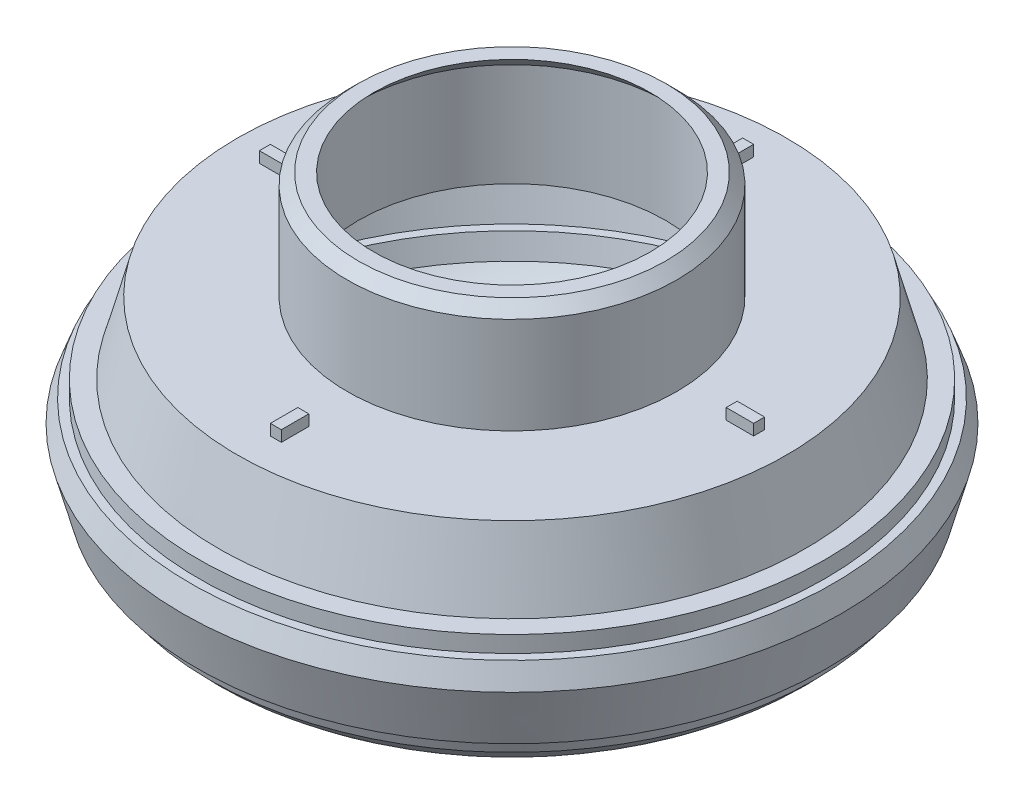
ISO-10303-21;
HEADER;
FILE_DESCRIPTION(('STEP AP214'),'2;1');
FILE_NAME('part.step','',(''),(''),'','','');
FILE_SCHEMA(('AUTOMOTIVE_DESIGN { 1 0 10303 214 1 1 1 1 }'));
ENDSEC;
DATA;
#1=APPLICATION_CONTEXT('core data for automotive mechanical design processes');
#2=APPLICATION_PROTOCOL_DEFINITION('international standard','automotive_design',2000,#1);
#3=PRODUCT_CONTEXT('',#1,'mechanical');
#4=PRODUCT('Part','Part','',(#3));
#5=PRODUCT_RELATED_PRODUCT_CATEGORY('part','',(#4));
#6=PRODUCT_DEFINITION_FORMATION('','',#4);
#7=PRODUCT_DEFINITION_CONTEXT('part definition',#1,'design');
#8=PRODUCT_DEFINITION('design','',#6,#7);
#9=PRODUCT_DEFINITION_SHAPE('','',#8);
#10=(LENGTH_UNIT() NAMED_UNIT(*) SI_UNIT(.MILLI.,.METRE.));
#11=(NAMED_UNIT(*) PLANE_ANGLE_UNIT() SI_UNIT($,.RADIAN.));
#12=(NAMED_UNIT(*) SI_UNIT($,.STERADIAN.) SOLID_ANGLE_UNIT());
#13=UNCERTAINTY_MEASURE_WITH_UNIT(LENGTH_MEASURE(1.E-05),#10,'distance_accuracy_value','');
#14=(GEOMETRIC_REPRESENTATION_CONTEXT(3) GLOBAL_UNCERTAINTY_ASSIGNED_CONTEXT((#13)) GLOBAL_UNIT_ASSIGNED_CONTEXT((#10,
#11,#12)) REPRESENTATION_CONTEXT('',''));
#15=CARTESIAN_POINT('',(0.,0.,0.));
#16=DIRECTION('',(0.,0.,1.));
#17=DIRECTION('',(1.,0.,0.));
#18=AXIS2_PLACEMENT_3D('',#15,#16,#17);
#19=CARTESIAN_POINT('',(-25.,10.,0.));
#20=DIRECTION('',(0.,1.,0.));
#21=DIRECTION('',(-1.,0.,0.));
#22=AXIS2_PLACEMENT_3D('',#19,#20,#21);
#23=PLANE('',#22);
#24=CARTESIAN_POINT('',(0.,10.,0.));
#25=DIRECTION('',(0.,1.,0.));
#26=DIRECTION('',(-1.,0.,0.));
#27=AXIS2_PLACEMENT_3D('',#24,#25,#26);
#28=CIRCLE('',#27,15.);
#29=CARTESIAN_POINT('',(-15.,10.,0.));
#30=VERTEX_POINT('',#29);
#31=EDGE_CURVE('E306',#30,#30,#28,.T.);
#32=ORIENTED_EDGE('',*,*,#31,.F.);
#33=EDGE_LOOP('',(#32));
#34=FACE_BOUND('',#33,.T.);
#35=CARTESIAN_POINT('',(0.,10.,0.));
#36=DIRECTION('',(0.,1.,0.));
#37=DIRECTION('',(-1.,0.,0.));
#38=AXIS2_PLACEMENT_3D('',#35,#36,#37);
#39=CIRCLE('',#38,25.);
#40=CARTESIAN_POINT('',(-25.,10.,0.));
#41=VERTEX_POINT('',#40);
#42=EDGE_CURVE('E333',#41,#41,#39,.T.);
#43=ORIENTED_EDGE('',*,*,#42,.T.);
#44=EDGE_LOOP('',(#43));
#45=FACE_BOUND('',#44,.T.);
#46=DIRECTION('',(-1.,0.,0.));
#47=VECTOR('',#46,1.);
#48=CARTESIAN_POINT('',(-19.5,10.,0.));
#49=LINE('',#48,#47);
#50=CARTESIAN_POINT('',(-19.5,10.,0.));
#51=VERTEX_POINT('',#50);
#52=CARTESIAN_POINT('',(-22.,10.,0.));
#53=VERTEX_POINT('',#52);
#54=EDGE_CURVE('E251',#51,#53,#49,.T.);
#55=ORIENTED_EDGE('',*,*,#54,.F.);
#56=DIRECTION('',(0.,0.,-1.));
#57=VECTOR('',#56,1.);
#58=CARTESIAN_POINT('',(-19.5,10.,0.));
#59=LINE('',#58,#57);
#60=CARTESIAN_POINT('',(-19.5,10.,1.));
#61=VERTEX_POINT('',#60);
#62=EDGE_CURVE('E237',#61,#51,#59,.T.);
#63=ORIENTED_EDGE('',*,*,#62,.F.);
#64=DIRECTION('',(1.,0.,0.));
#65=VECTOR('',#64,1.);
#66=CARTESIAN_POINT('',(-19.5,10.,1.));
#67=LINE('',#66,#65);
#68=CARTESIAN_POINT('',(-22.,10.,1.));
#69=VERTEX_POINT('',#68);
#70=EDGE_CURVE('E242',#69,#61,#67,.T.);
#71=ORIENTED_EDGE('',*,*,#70,.F.);
#72=DIRECTION('',(0.,0.,1.));
#73=VECTOR('',#72,1.);
#74=CARTESIAN_POINT('',(-22.,10.,0.));
#75=LINE('',#74,#73);
#76=EDGE_CURVE('E253',#53,#69,#75,.T.);
#77=ORIENTED_EDGE('',*,*,#76,.F.);
#78=EDGE_LOOP('',(#55,#63,#71,#77));
#79=FACE_BOUND('',#78,.T.);
#80=DIRECTION('',(0.,0.,1.));
#81=VECTOR('',#80,1.);
#82=CARTESIAN_POINT('',(0.,10.,19.5));
#83=LINE('',#82,#81);
#84=CARTESIAN_POINT('',(0.,10.,19.5));
#85=VERTEX_POINT('',#84);
#86=CARTESIAN_POINT('',(0.,10.,22.));
#87=VERTEX_POINT('',#86);
#88=EDGE_CURVE('E222',#85,#87,#83,.T.);
#89=ORIENTED_EDGE('',*,*,#88,.F.);
#90=DIRECTION('',(-1.,0.,0.));
#91=VECTOR('',#90,1.);
#92=CARTESIAN_POINT('',(0.,10.,19.5));
#93=LINE('',#92,#91);
#94=CARTESIAN_POINT('',(1.00000000000007,10.,19.5));
#95=VERTEX_POINT('',#94);
#96=EDGE_CURVE('E208',#95,#85,#93,.T.);
#97=ORIENTED_EDGE('',*,*,#96,.F.);
#98=DIRECTION('',(0.,0.,-1.));
#99=VECTOR('',#98,1.);
#100=CARTESIAN_POINT('',(1.00000000000007,10.,19.5));
#101=LINE('',#100,#99);
#102=CARTESIAN_POINT('',(1.00000000000008,10.,22.));
#103=VERTEX_POINT('',#102);
#104=EDGE_CURVE('E213',#103,#95,#101,.T.);
#105=ORIENTED_EDGE('',*,*,#104,.F.);
#106=DIRECTION('',(1.,0.,0.));
#107=VECTOR('',#106,1.);
#108=CARTESIAN_POINT('',(0.,10.,22.));
#109=LINE('',#108,#107);
#110=EDGE_CURVE('E224',#87,#103,#109,.T.);
#111=ORIENTED_EDGE('',*,*,#110,.F.);
#112=EDGE_LOOP('',(#89,#97,#105,#111));
#113=FACE_BOUND('',#112,.T.);
#114=DIRECTION('',(1.,0.,0.));
#115=VECTOR('',#114,1.);
#116=CARTESIAN_POINT('',(19.5,10.,0.));
#117=LINE('',#116,#115);
#118=CARTESIAN_POINT('',(19.5,10.,0.));
#119=VERTEX_POINT('',#118);
#120=CARTESIAN_POINT('',(22.,10.,0.));
#121=VERTEX_POINT('',#120);
#122=EDGE_CURVE('E180',#119,#121,#117,.T.);
#123=ORIENTED_EDGE('',*,*,#122,.F.);
#124=DIRECTION('',(0.,0.,1.));
#125=VECTOR('',#124,1.);
#126=CARTESIAN_POINT('',(19.5,10.,0.));
#127=LINE('',#126,#125);
#128=CARTESIAN_POINT('',(19.5,10.,-1.));
#129=VERTEX_POINT('',#128);
#130=EDGE_CURVE('E177',#129,#119,#127,.T.);
#131=ORIENTED_EDGE('',*,*,#130,.F.);
#132=DIRECTION('',(-1.,0.,0.));
#133=VECTOR('',#132,1.);
#134=CARTESIAN_POINT('',(19.5,10.,-1.));
#135=LINE('',#134,#133);
#136=CARTESIAN_POINT('',(22.,10.,-1.));
#137=VERTEX_POINT('',#136);
#138=EDGE_CURVE('E189',#137,#129,#135,.T.);
#139=ORIENTED_EDGE('',*,*,#138,.F.);
#140=DIRECTION('',(0.,0.,-1.));
#141=VECTOR('',#140,1.);
#142=CARTESIAN_POINT('',(22.,10.,0.));
#143=LINE('',#142,#141);
#144=EDGE_CURVE('E197',#121,#137,#143,.T.);
#145=ORIENTED_EDGE('',*,*,#144,.F.);
#146=EDGE_LOOP('',(#123,#131,#139,#145));
#147=FACE_BOUND('',#146,.T.);
#148=DIRECTION('',(0.,0.,-1.));
#149=VECTOR('',#148,1.);
#150=CARTESIAN_POINT('',(-2.08678023434132E-13,10.,-19.5));
#151=LINE('',#150,#149);
#152=CARTESIAN_POINT('',(-2.08678023434132E-13,10.,-19.5));
#153=VERTEX_POINT('',#152);
#154=CARTESIAN_POINT('',(-2.34698875573785E-13,10.,-22.));
#155=VERTEX_POINT('',#154);
#156=EDGE_CURVE('E437',#153,#155,#151,.T.);
#157=ORIENTED_EDGE('',*,*,#156,.F.);
#158=DIRECTION('',(1.,0.,0.));
#159=VECTOR('',#158,1.);
#160=CARTESIAN_POINT('',(-2.08678023434132E-13,10.,-19.5));
#161=LINE('',#160,#159);
#162=CARTESIAN_POINT('',(-1.00000000000021,10.,-19.5));
#163=VERTEX_POINT('',#162);
#164=EDGE_CURVE('E175',#163,#153,#161,.T.);
#165=ORIENTED_EDGE('',*,*,#164,.F.);
#166=DIRECTION('',(0.,0.,1.));
#167=VECTOR('',#166,1.);
#168=CARTESIAN_POINT('',(-1.00000000000021,10.,-19.5));
#169=LINE('',#168,#167);
#170=CARTESIAN_POINT('',(-1.00000000000023,10.,-22.));
#171=VERTEX_POINT('',#170);
#172=EDGE_CURVE('E171',#171,#163,#169,.T.);
#173=ORIENTED_EDGE('',*,*,#172,.F.);
#174=DIRECTION('',(-1.,0.,0.));
#175=VECTOR('',#174,1.);
#176=CARTESIAN_POINT('',(-2.34698875573785E-13,10.,-22.));
#177=LINE('',#176,#175);
#178=EDGE_CURVE('E439',#155,#171,#177,.T.);
#179=ORIENTED_EDGE('',*,*,#178,.F.);
#180=EDGE_LOOP('',(#157,#165,#173,#179));
#181=FACE_BOUND('',#180,.T.);
#182=ADVANCED_FACE('F38',(#34,#45,#79,#113,#147,#181),#23,.T.);
#183=CARTESIAN_POINT('',(0.,0.,0.));
#184=DIRECTION('',(0.,1.,0.));
#185=DIRECTION('',(-1.,0.,0.));
#186=AXIS2_PLACEMENT_3D('',#183,#184,#185);
#187=TOROIDAL_SURFACE('',#186,19.9006579232146,10.);
#188=CARTESIAN_POINT('',(0.,-10.,0.));
#189=DIRECTION('',(0.,1.,0.));
#190=DIRECTION('',(-1.,0.,0.));
#191=AXIS2_PLACEMENT_3D('',#188,#189,#190);
#192=CIRCLE('',#191,19.9006579232146);
#193=CARTESIAN_POINT('',(-19.9006579232146,-10.,0.));
#194=VERTEX_POINT('',#193);
#195=EDGE_CURVE('E309',#194,#194,#192,.T.);
#196=ORIENTED_EDGE('',*,*,#195,.T.);
#197=EDGE_LOOP('',(#196));
#198=FACE_BOUND('',#197,.T.);
#199=CARTESIAN_POINT('',(0.,-6.49999999999995,0.));
#200=DIRECTION('',(0.,1.,0.));
#201=DIRECTION('',(-1.,0.,0.));
#202=AXIS2_PLACEMENT_3D('',#199,#200,#201);
#203=CIRCLE('',#202,27.4999999999999);
#204=CARTESIAN_POINT('',(-27.4999999999999,-6.49999999999995,0.));
#205=VERTEX_POINT('',#204);
#206=EDGE_CURVE('E303',#205,#205,#203,.T.);
#207=ORIENTED_EDGE('',*,*,#206,.F.);
#208=EDGE_LOOP('',(#207));
#209=FACE_BOUND('',#208,.T.);
#210=ADVANCED_FACE('F357',(#198,#209),#187,.T.);
#211=CARTESIAN_POINT('',(0.,-10.,0.));
#212=DIRECTION('',(0.,-1.,0.));
#213=DIRECTION('',(1.,0.,0.));
#214=AXIS2_PLACEMENT_3D('',#211,#212,#213);
#215=PLANE('',#214);
#216=ORIENTED_EDGE('',*,*,#195,.F.);
#217=EDGE_LOOP('',(#216));
#218=FACE_BOUND('',#217,.T.);
#219=ADVANCED_FACE('F363',(#218),#215,.T.);
#220=CARTESIAN_POINT('',(0.,10.,0.));
#221=DIRECTION('',(0.,-1.,0.));
#222=DIRECTION('',(1.,0.,0.));
#223=AXIS2_PLACEMENT_3D('',#220,#221,#222);
#224=CONICAL_SURFACE('',#223,25.,0.261799387799155);
#225=CARTESIAN_POINT('',(0.,3.50000000000006,0.));
#226=DIRECTION('',(0.,1.,0.));
#227=DIRECTION('',(-1.,0.,0.));
#228=AXIS2_PLACEMENT_3D('',#225,#226,#227);
#229=CIRCLE('',#228,26.7416697508023);
#230=CARTESIAN_POINT('',(-26.7416697508023,3.50000000000006,0.));
#231=VERTEX_POINT('',#230);
#232=EDGE_CURVE('E330',#231,#231,#229,.T.);
#233=ORIENTED_EDGE('',*,*,#232,.T.);
#234=EDGE_LOOP('',(#233));
#235=FACE_BOUND('',#234,.T.);
#236=ORIENTED_EDGE('',*,*,#42,.F.);
#237=EDGE_LOOP('',(#236));
#238=FACE_BOUND('',#237,.T.);
#239=ADVANCED_FACE('F369',(#235,#238),#224,.T.);
#240=CARTESIAN_POINT('',(-26.7416697508023,3.50000000000002,0.));
#241=DIRECTION('',(0.,1.,0.));
#242=DIRECTION('',(-1.,0.,0.));
#243=AXIS2_PLACEMENT_3D('',#240,#241,#242);
#244=PLANE('',#243);
#245=CARTESIAN_POINT('',(0.,3.50000000000006,0.));
#246=DIRECTION('',(0.,1.,0.));
#247=DIRECTION('',(-1.,0.,0.));
#248=AXIS2_PLACEMENT_3D('',#245,#246,#247);
#249=CIRCLE('',#248,28.5);
#250=CARTESIAN_POINT('',(-28.5,3.50000000000006,0.));
#251=VERTEX_POINT('',#250);
#252=EDGE_CURVE('E327',#251,#251,#249,.T.);
#253=ORIENTED_EDGE('',*,*,#252,.T.);
#254=EDGE_LOOP('',(#253));
#255=FACE_BOUND('',#254,.T.);
#256=ORIENTED_EDGE('',*,*,#232,.F.);
#257=EDGE_LOOP('',(#256));
#258=FACE_BOUND('',#257,.T.);
#259=ADVANCED_FACE('F376',(#255,#258),#244,.T.);
#260=CARTESIAN_POINT('',(0.,614.019679743481,0.));
#261=DIRECTION('',(0.,1.,0.));
#262=DIRECTION('',(-1.,0.,0.));
#263=AXIS2_PLACEMENT_3D('',#260,#261,#262);
#264=CYLINDRICAL_SURFACE('',#263,28.5);
#265=CARTESIAN_POINT('',(0.,2.,0.));
#266=DIRECTION('',(0.,1.,0.));
#267=DIRECTION('',(-1.,0.,0.));
#268=AXIS2_PLACEMENT_3D('',#265,#266,#267);
#269=CIRCLE('',#268,28.5);
#270=CARTESIAN_POINT('',(-28.5,2.,0.));
#271=VERTEX_POINT('',#270);
#272=EDGE_CURVE('E324',#271,#271,#269,.T.);
#273=ORIENTED_EDGE('',*,*,#272,.T.);
#274=EDGE_LOOP('',(#273));
#275=FACE_BOUND('',#274,.T.);
#276=ORIENTED_EDGE('',*,*,#252,.F.);
#277=EDGE_LOOP('',(#276));
#278=FACE_BOUND('',#277,.T.);
#279=ADVANCED_FACE('F409',(#275,#278),#264,.T.);
#280=CARTESIAN_POINT('',(-28.5,2.00000000000002,0.));
#281=DIRECTION('',(0.,1.,0.));
#282=DIRECTION('',(-1.,0.,0.));
#283=AXIS2_PLACEMENT_3D('',#280,#281,#282);
#284=PLANE('',#283);
#285=CARTESIAN_POINT('',(0.,2.,0.));
#286=DIRECTION('',(0.,1.,0.));
#287=DIRECTION('',(-1.,0.,0.));
#288=AXIS2_PLACEMENT_3D('',#285,#286,#287);
#289=CIRCLE('',#288,29.2583302491977);
#290=CARTESIAN_POINT('',(-29.2583302491978,2.,0.));
#291=VERTEX_POINT('',#290);
#292=EDGE_CURVE('E321',#291,#291,#289,.T.);
#293=ORIENTED_EDGE('',*,*,#292,.T.);
#294=EDGE_LOOP('',(#293));
#295=FACE_BOUND('',#294,.T.);
#296=ORIENTED_EDGE('',*,*,#272,.F.);
#297=EDGE_LOOP('',(#296));
#298=FACE_BOUND('',#297,.T.);
#299=ADVANCED_FACE('F403',(#295,#298),#284,.T.);
#300=CARTESIAN_POINT('',(0.,2.,0.));
#301=DIRECTION('',(0.,-1.,0.));
#302=DIRECTION('',(1.,0.,0.));
#303=AXIS2_PLACEMENT_3D('',#300,#301,#302);
#304=CONICAL_SURFACE('',#303,29.2583302491977,0.355114063261972);
#305=CARTESIAN_POINT('',(0.,0.,0.));
#306=DIRECTION('',(0.,1.,0.));
#307=DIRECTION('',(-1.,0.,0.));
#308=AXIS2_PLACEMENT_3D('',#305,#306,#307);
#309=CIRCLE('',#308,29.9999999999999);
#310=CARTESIAN_POINT('',(-29.9999999999999,0.,0.));
#311=VERTEX_POINT('',#310);
#312=EDGE_CURVE('E318',#311,#311,#309,.T.);
#313=ORIENTED_EDGE('',*,*,#312,.T.);
#314=EDGE_LOOP('',(#313));
#315=FACE_BOUND('',#314,.T.);
#316=ORIENTED_EDGE('',*,*,#292,.F.);
#317=EDGE_LOOP('',(#316));
#318=FACE_BOUND('',#317,.T.);
#319=ADVANCED_FACE('F397',(#315,#318),#304,.T.);
#320=CARTESIAN_POINT('',(0.,0.,0.));
#321=DIRECTION('',(0.,1.,0.));
#322=DIRECTION('',(-1.,0.,0.));
#323=AXIS2_PLACEMENT_3D('',#320,#321,#322);
#324=CONICAL_SURFACE('',#323,29.9999999999999,0.261799387799138);
#325=CARTESIAN_POINT('',(0.,-5.,0.));
#326=DIRECTION('',(0.,1.,0.));
#327=DIRECTION('',(-1.,0.,0.));
#328=AXIS2_PLACEMENT_3D('',#325,#326,#327);
#329=CIRCLE('',#328,28.6602540378443);
#330=CARTESIAN_POINT('',(-28.6602540378444,-5.00000000000001,0.));
#331=VERTEX_POINT('',#330);
#332=EDGE_CURVE('E315',#331,#331,#329,.T.);
#333=ORIENTED_EDGE('',*,*,#332,.T.);
#334=EDGE_LOOP('',(#333));
#335=FACE_BOUND('',#334,.T.);
#336=ORIENTED_EDGE('',*,*,#312,.F.);
#337=EDGE_LOOP('',(#336));
#338=FACE_BOUND('',#337,.T.);
#339=ADVANCED_FACE('F391',(#335,#338),#324,.T.);
#340=CARTESIAN_POINT('',(-28.6602540378444,-4.99999999999999,0.));
#341=DIRECTION('',(0.,-1.,0.));
#342=DIRECTION('',(1.,0.,0.));
#343=AXIS2_PLACEMENT_3D('',#340,#341,#342);
#344=PLANE('',#343);
#345=CARTESIAN_POINT('',(0.,-5.,0.));
#346=DIRECTION('',(0.,1.,0.));
#347=DIRECTION('',(-1.,0.,0.));
#348=AXIS2_PLACEMENT_3D('',#345,#346,#347);
#349=CIRCLE('',#348,27.9019237886466);
#350=CARTESIAN_POINT('',(-27.9019237886466,-5.00000000000001,0.));
#351=VERTEX_POINT('',#350);
#352=EDGE_CURVE('E312',#351,#351,#349,.T.);
#353=ORIENTED_EDGE('',*,*,#352,.T.);
#354=EDGE_LOOP('',(#353));
#355=FACE_BOUND('',#354,.T.);
#356=ORIENTED_EDGE('',*,*,#332,.F.);
#357=EDGE_LOOP('',(#356));
#358=FACE_BOUND('',#357,.T.);
#359=ADVANCED_FACE('F385',(#355,#358),#344,.T.);
#360=CARTESIAN_POINT('',(0.,-5.,0.));
#361=DIRECTION('',(0.,1.,0.));
#362=DIRECTION('',(-1.,0.,0.));
#363=AXIS2_PLACEMENT_3D('',#360,#361,#362);
#364=CONICAL_SURFACE('',#363,27.9019237886466,0.261799387799165);
#365=ORIENTED_EDGE('',*,*,#206,.T.);
#366=EDGE_LOOP('',(#365));
#367=FACE_BOUND('',#366,.T.);
#368=ORIENTED_EDGE('',*,*,#352,.F.);
#369=EDGE_LOOP('',(#368));
#370=FACE_BOUND('',#369,.T.);
#371=ADVANCED_FACE('F382',(#367,#370),#364,.T.);
#372=CARTESIAN_POINT('',(0.,19.8,0.));
#373=DIRECTION('',(0.,-1.,0.));
#374=DIRECTION('',(1.,0.,0.));
#375=AXIS2_PLACEMENT_3D('',#372,#373,#374);
#376=CYLINDRICAL_SURFACE('',#375,15.);
#377=CARTESIAN_POINT('',(0.,18.8,0.));
#378=DIRECTION('',(0.,1.,0.));
#379=DIRECTION('',(-1.,0.,0.));
#380=AXIS2_PLACEMENT_3D('',#377,#378,#379);
#381=CIRCLE('',#380,15.);
#382=CARTESIAN_POINT('',(-15.,18.8,0.));
#383=VERTEX_POINT('',#382);
#384=EDGE_CURVE('E11',#383,#383,#381,.F.);
#385=ORIENTED_EDGE('',*,*,#384,.T.);
#386=EDGE_LOOP('',(#385));
#387=FACE_BOUND('',#386,.T.);
#388=ORIENTED_EDGE('',*,*,#31,.T.);
#389=EDGE_LOOP('',(#388));
#390=FACE_BOUND('',#389,.T.);
#391=ADVANCED_FACE('F352',(#387,#390),#376,.T.);
#392=CARTESIAN_POINT('',(0.,19.8,0.));
#393=DIRECTION('',(0.,1.,0.));
#394=DIRECTION('',(-1.,0.,0.));
#395=AXIS2_PLACEMENT_3D('',#392,#393,#394);
#396=PLANE('',#395);
#397=CARTESIAN_POINT('',(0.,19.8,0.));
#398=DIRECTION('',(0.,1.,0.));
#399=DIRECTION('',(-1.,0.,0.));
#400=AXIS2_PLACEMENT_3D('',#397,#398,#399);
#401=CIRCLE('',#400,12.5857864376269);
#402=CARTESIAN_POINT('',(-12.5857864376269,19.8,0.));
#403=VERTEX_POINT('',#402);
#404=EDGE_CURVE('E299',#403,#403,#401,.T.);
#405=ORIENTED_EDGE('',*,*,#404,.F.);
#406=EDGE_LOOP('',(#405));
#407=FACE_BOUND('',#406,.T.);
#408=CARTESIAN_POINT('',(0.,19.8,0.));
#409=DIRECTION('',(0.,1.,0.));
#410=DIRECTION('',(-1.,0.,0.));
#411=AXIS2_PLACEMENT_3D('',#408,#409,#410);
#412=CIRCLE('',#411,14.);
#413=CARTESIAN_POINT('',(-14.,19.8,0.));
#414=VERTEX_POINT('',#413);
#415=EDGE_CURVE('E46',#414,#414,#412,.T.);
#416=ORIENTED_EDGE('',*,*,#415,.T.);
#417=EDGE_LOOP('',(#416));
#418=FACE_BOUND('',#417,.T.);
#419=ADVANCED_FACE('F340',(#407,#418),#396,.T.);
#420=CARTESIAN_POINT('',(0.,19.8,0.));
#421=DIRECTION('',(0.,-1.,0.));
#422=DIRECTION('',(1.,0.,0.));
#423=AXIS2_PLACEMENT_3D('',#420,#421,#422);
#424=CONICAL_SURFACE('',#423,14.,0.785398163397442);
#425=ORIENTED_EDGE('',*,*,#384,.F.);
#426=EDGE_LOOP('',(#425));
#427=FACE_BOUND('',#426,.T.);
#428=ORIENTED_EDGE('',*,*,#415,.F.);
#429=EDGE_LOOP('',(#428));
#430=FACE_BOUND('',#429,.T.);
#431=ADVANCED_FACE('F40',(#427,#430),#424,.T.);
#432=CARTESIAN_POINT('',(0.,0.,0.));
#433=DIRECTION('',(0.,1.,0.));
#434=DIRECTION('',(-1.,0.,0.));
#435=AXIS2_PLACEMENT_3D('',#432,#433,#434);
#436=TOROIDAL_SURFACE('',#435,19.9006579232146,9.);
#437=CARTESIAN_POINT('',(0.,-9.00000000000001,0.));
#438=DIRECTION('',(0.,1.,0.));
#439=DIRECTION('',(-1.,0.,0.));
#440=AXIS2_PLACEMENT_3D('',#437,#438,#439);
#441=CIRCLE('',#440,19.9006579232146);
#442=CARTESIAN_POINT('',(-19.9006579232146,-9.00000000000001,0.));
#443=VERTEX_POINT('',#442);
#444=EDGE_CURVE('E267',#443,#443,#441,.T.);
#445=ORIENTED_EDGE('',*,*,#444,.F.);
#446=EDGE_LOOP('',(#445));
#447=FACE_BOUND('',#446,.T.);
#448=CARTESIAN_POINT('',(0.,-6.01616704365916,0.));
#449=DIRECTION('',(0.,1.,0.));
#450=DIRECTION('',(-1.,0.,0.));
#451=AXIS2_PLACEMENT_3D('',#448,#449,#450);
#452=CIRCLE('',#451,26.5943664695129);
#453=CARTESIAN_POINT('',(-26.5943664695129,-6.01616704365916,0.));
#454=VERTEX_POINT('',#453);
#455=EDGE_CURVE('E266',#454,#454,#452,.T.);
#456=ORIENTED_EDGE('',*,*,#455,.T.);
#457=EDGE_LOOP('',(#456));
#458=FACE_BOUND('',#457,.T.);
#459=ADVANCED_FACE('F343',(#447,#458),#436,.F.);
#460=CARTESIAN_POINT('',(0.,-9.00000000000001,0.));
#461=DIRECTION('',(0.,-1.,0.));
#462=DIRECTION('',(1.,0.,0.));
#463=AXIS2_PLACEMENT_3D('',#460,#461,#462);
#464=PLANE('',#463);
#465=ORIENTED_EDGE('',*,*,#444,.T.);
#466=EDGE_LOOP('',(#465));
#467=FACE_BOUND('',#466,.T.);
#468=ADVANCED_FACE('F349',(#467),#464,.F.);
#469=CARTESIAN_POINT('',(-25.,9.00000000000001,0.));
#470=DIRECTION('',(0.,1.,0.));
#471=DIRECTION('',(-1.,0.,0.));
#472=AXIS2_PLACEMENT_3D('',#469,#470,#471);
#473=PLANE('',#472);
#474=CARTESIAN_POINT('',(0.,9.00000000000001,0.));
#475=DIRECTION('',(0.,1.,0.));
#476=DIRECTION('',(-1.,0.,0.));
#477=AXIS2_PLACEMENT_3D('',#474,#475,#476);
#478=CIRCLE('',#477,14.);
#479=CARTESIAN_POINT('',(-14.,9.00000000000001,0.));
#480=VERTEX_POINT('',#479);
#481=EDGE_CURVE('E270',#480,#480,#478,.T.);
#482=ORIENTED_EDGE('',*,*,#481,.T.);
#483=EDGE_LOOP('',(#482));
#484=FACE_BOUND('',#483,.T.);
#485=CARTESIAN_POINT('',(0.,9.00000000000001,0.));
#486=DIRECTION('',(0.,1.,0.));
#487=DIRECTION('',(-1.,0.,0.));
#488=AXIS2_PLACEMENT_3D('',#485,#486,#487);
#489=CIRCLE('',#488,24.232673012021);
#490=CARTESIAN_POINT('',(-24.2326730120211,9.00000000000001,0.));
#491=VERTEX_POINT('',#490);
#492=EDGE_CURVE('E271',#491,#491,#489,.T.);
#493=ORIENTED_EDGE('',*,*,#492,.F.);
#494=EDGE_LOOP('',(#493));
#495=FACE_BOUND('',#494,.T.);
#496=ADVANCED_FACE('F526',(#484,#495),#473,.F.);
#497=CARTESIAN_POINT('',(0.,9.74118095489748,0.));
#498=DIRECTION('',(0.,-1.,0.));
#499=DIRECTION('',(1.,0.,0.));
#500=AXIS2_PLACEMENT_3D('',#497,#498,#499);
#501=CONICAL_SURFACE('',#500,24.0340741737109,0.261799387799155);
#502=CARTESIAN_POINT('',(0.,2.50000000000002,0.));
#503=DIRECTION('',(0.,1.,0.));
#504=DIRECTION('',(-1.,0.,0.));
#505=AXIS2_PLACEMENT_3D('',#502,#503,#504);
#506=CIRCLE('',#505,25.9743427628234);
#507=CARTESIAN_POINT('',(-25.9743427628234,2.50000000000001,0.));
#508=VERTEX_POINT('',#507);
#509=EDGE_CURVE('E292',#508,#508,#506,.T.);
#510=ORIENTED_EDGE('',*,*,#509,.F.);
#511=EDGE_LOOP('',(#510));
#512=FACE_BOUND('',#511,.T.);
#513=ORIENTED_EDGE('',*,*,#492,.T.);
#514=EDGE_LOOP('',(#513));
#515=FACE_BOUND('',#514,.T.);
#516=ADVANCED_FACE('F530',(#512,#515),#501,.F.);
#517=CARTESIAN_POINT('',(-26.7416697508023,2.50000000000002,0.));
#518=DIRECTION('',(0.,1.,0.));
#519=DIRECTION('',(-1.,0.,0.));
#520=AXIS2_PLACEMENT_3D('',#517,#518,#519);
#521=PLANE('',#520);
#522=CARTESIAN_POINT('',(0.,2.50000000000006,0.));
#523=DIRECTION('',(0.,1.,0.));
#524=DIRECTION('',(-1.,0.,0.));
#525=AXIS2_PLACEMENT_3D('',#522,#523,#524);
#526=CIRCLE('',#525,27.5);
#527=CARTESIAN_POINT('',(-27.5,2.50000000000006,0.));
#528=VERTEX_POINT('',#527);
#529=EDGE_CURVE('E289',#528,#528,#526,.T.);
#530=ORIENTED_EDGE('',*,*,#529,.F.);
#531=EDGE_LOOP('',(#530));
#532=FACE_BOUND('',#531,.T.);
#533=ORIENTED_EDGE('',*,*,#509,.T.);
#534=EDGE_LOOP('',(#533));
#535=FACE_BOUND('',#534,.T.);
#536=ADVANCED_FACE('F534',(#532,#535),#521,.F.);
#537=CARTESIAN_POINT('',(0.,614.019679743481,0.));
#538=DIRECTION('',(0.,1.,0.));
#539=DIRECTION('',(-1.,0.,0.));
#540=AXIS2_PLACEMENT_3D('',#537,#538,#539);
#541=CYLINDRICAL_SURFACE('',#540,27.5);
#542=CARTESIAN_POINT('',(0.,1.,0.));
#543=DIRECTION('',(0.,1.,0.));
#544=DIRECTION('',(-1.,0.,0.));
#545=AXIS2_PLACEMENT_3D('',#542,#543,#544);
#546=CIRCLE('',#545,27.5);
#547=CARTESIAN_POINT('',(-27.5,1.,0.));
#548=VERTEX_POINT('',#547);
#549=EDGE_CURVE('E286',#548,#548,#546,.T.);
#550=ORIENTED_EDGE('',*,*,#549,.F.);
#551=EDGE_LOOP('',(#550));
#552=FACE_BOUND('',#551,.T.);
#553=ORIENTED_EDGE('',*,*,#529,.T.);
#554=EDGE_LOOP('',(#553));
#555=FACE_BOUND('',#554,.T.);
#556=ADVANCED_FACE('F538',(#552,#555),#541,.F.);
#557=CARTESIAN_POINT('',(-28.5,1.00000000000001,0.));
#558=DIRECTION('',(0.,1.,0.));
#559=DIRECTION('',(-1.,0.,0.));
#560=AXIS2_PLACEMENT_3D('',#557,#558,#559);
#561=PLANE('',#560);
#562=CARTESIAN_POINT('',(0.,1.00000000000001,0.));
#563=DIRECTION('',(0.,1.,0.));
#564=DIRECTION('',(-1.,0.,0.));
#565=AXIS2_PLACEMENT_3D('',#562,#563,#564);
#566=CIRCLE('',#565,28.5626199990585);
#567=CARTESIAN_POINT('',(-28.5626199990585,1.00000000000001,0.));
#568=VERTEX_POINT('',#567);
#569=EDGE_CURVE('E283',#568,#568,#566,.T.);
#570=ORIENTED_EDGE('',*,*,#569,.F.);
#571=EDGE_LOOP('',(#570));
#572=FACE_BOUND('',#571,.T.);
#573=ORIENTED_EDGE('',*,*,#549,.T.);
#574=EDGE_LOOP('',(#573));
#575=FACE_BOUND('',#574,.T.);
#576=ADVANCED_FACE('F542',(#572,#575),#561,.F.);
#577=CARTESIAN_POINT('',(0.,1.65230268600851,0.));
#578=DIRECTION('',(0.,-1.,0.));
#579=DIRECTION('',(1.,0.,0.));
#580=AXIS2_PLACEMENT_3D('',#577,#578,#579);
#581=CONICAL_SURFACE('',#580,28.3207234137688,0.355114063261972);
#582=CARTESIAN_POINT('',(0.,-0.0489507279608919,0.));
#583=DIRECTION('',(0.,1.,0.));
#584=DIRECTION('',(-1.,0.,0.));
#585=AXIS2_PLACEMENT_3D('',#582,#583,#584);
#586=CIRCLE('',#585,28.9516075115638);
#587=CARTESIAN_POINT('',(-28.9516075115638,-0.0489507279608933,0.));
#588=VERTEX_POINT('',#587);
#589=EDGE_CURVE('E280',#588,#588,#586,.T.);
#590=ORIENTED_EDGE('',*,*,#589,.F.);
#591=EDGE_LOOP('',(#590));
#592=FACE_BOUND('',#591,.T.);
#593=ORIENTED_EDGE('',*,*,#569,.T.);
#594=EDGE_LOOP('',(#593));
#595=FACE_BOUND('',#594,.T.);
#596=ADVANCED_FACE('F546',(#592,#595),#581,.F.);
#597=CARTESIAN_POINT('',(0.,0.258819045102512,0.));
#598=DIRECTION('',(0.,1.,0.));
#599=DIRECTION('',(-1.,0.,0.));
#600=AXIS2_PLACEMENT_3D('',#597,#598,#599);
#601=CONICAL_SURFACE('',#600,29.0340741737108,0.261799387799138);
#602=CARTESIAN_POINT('',(0.,-3.99999999999999,0.));
#603=DIRECTION('',(0.,-1.,0.));
#604=DIRECTION('',(1.,0.,0.));
#605=AXIS2_PLACEMENT_3D('',#602,#603,#604);
#606=CIRCLE('',#605,27.8929270498654);
#607=CARTESIAN_POINT('',(27.8929270498653,-3.99999999999999,0.));
#608=VERTEX_POINT('',#607);
#609=EDGE_CURVE('E277',#608,#608,#606,.F.);
#610=ORIENTED_EDGE('',*,*,#609,.F.);
#611=EDGE_LOOP('',(#610));
#612=FACE_BOUND('',#611,.T.);
#613=ORIENTED_EDGE('',*,*,#589,.T.);
#614=EDGE_LOOP('',(#613));
#615=FACE_BOUND('',#614,.T.);
#616=ADVANCED_FACE('F550',(#612,#615),#601,.F.);
#617=CARTESIAN_POINT('',(-28.6602540378444,-3.99999999999999,0.));
#618=DIRECTION('',(0.,-1.,0.));
#619=DIRECTION('',(1.,0.,0.));
#620=AXIS2_PLACEMENT_3D('',#617,#618,#619);
#621=PLANE('',#620);
#622=CARTESIAN_POINT('',(0.,-3.99999999999999,0.));
#623=DIRECTION('',(0.,-1.,0.));
#624=DIRECTION('',(1.,0.,0.));
#625=AXIS2_PLACEMENT_3D('',#622,#623,#624);
#626=CIRCLE('',#625,27.1345968006677);
#627=CARTESIAN_POINT('',(27.1345968006676,-3.99999999999999,0.));
#628=VERTEX_POINT('',#627);
#629=EDGE_CURVE('E274',#628,#628,#626,.F.);
#630=ORIENTED_EDGE('',*,*,#629,.F.);
#631=EDGE_LOOP('',(#630));
#632=FACE_BOUND('',#631,.T.);
#633=ORIENTED_EDGE('',*,*,#609,.T.);
#634=EDGE_LOOP('',(#633));
#635=FACE_BOUND('',#634,.T.);
#636=ADVANCED_FACE('F554',(#632,#635),#621,.F.);
#637=CARTESIAN_POINT('',(0.,-4.74118095489746,0.));
#638=DIRECTION('',(0.,1.,0.));
#639=DIRECTION('',(-1.,0.,0.));
#640=AXIS2_PLACEMENT_3D('',#637,#638,#639);
#641=CONICAL_SURFACE('',#640,26.9359979623575,0.261799387799165);
#642=ORIENTED_EDGE('',*,*,#455,.F.);
#643=EDGE_LOOP('',(#642));
#644=FACE_BOUND('',#643,.T.);
#645=ORIENTED_EDGE('',*,*,#629,.T.);
#646=EDGE_LOOP('',(#645));
#647=FACE_BOUND('',#646,.T.);
#648=ADVANCED_FACE('F558',(#644,#647),#641,.F.);
#649=CARTESIAN_POINT('',(0.,19.8,0.));
#650=DIRECTION('',(0.,-1.,0.));
#651=DIRECTION('',(1.,0.,0.));
#652=AXIS2_PLACEMENT_3D('',#649,#650,#651);
#653=CYLINDRICAL_SURFACE('',#652,14.);
#654=CARTESIAN_POINT('',(0.,18.3857864376269,0.));
#655=DIRECTION('',(0.,-1.,0.));
#656=DIRECTION('',(1.,0.,0.));
#657=AXIS2_PLACEMENT_3D('',#654,#655,#656);
#658=CIRCLE('',#657,14.);
#659=CARTESIAN_POINT('',(14.,18.3857864376269,0.));
#660=VERTEX_POINT('',#659);
#661=EDGE_CURVE('E300',#660,#660,#658,.T.);
#662=ORIENTED_EDGE('',*,*,#661,.F.);
#663=EDGE_LOOP('',(#662));
#664=FACE_BOUND('',#663,.T.);
#665=ORIENTED_EDGE('',*,*,#481,.F.);
#666=EDGE_LOOP('',(#665));
#667=FACE_BOUND('',#666,.T.);
#668=ADVANCED_FACE('F562',(#664,#667),#653,.F.);
#669=CARTESIAN_POINT('',(0.,19.0928932188135,0.));
#670=DIRECTION('',(0.,-1.,0.));
#671=DIRECTION('',(1.,0.,0.));
#672=AXIS2_PLACEMENT_3D('',#669,#670,#671);
#673=CONICAL_SURFACE('',#672,13.2928932188135,0.785398163397442);
#674=ORIENTED_EDGE('',*,*,#661,.T.);
#675=EDGE_LOOP('',(#674));
#676=FACE_BOUND('',#675,.T.);
#677=ORIENTED_EDGE('',*,*,#404,.T.);
#678=EDGE_LOOP('',(#677));
#679=FACE_BOUND('',#678,.T.);
#680=ADVANCED_FACE('F521',(#676,#679),#673,.F.);
#681=CARTESIAN_POINT('',(-19.5,11.,0.));
#682=DIRECTION('',(-1.,0.,0.));
#683=DIRECTION('',(0.,-1.,0.));
#684=AXIS2_PLACEMENT_3D('',#681,#682,#683);
#685=PLANE('',#684);
#686=ORIENTED_EDGE('',*,*,#62,.T.);
#687=DIRECTION('',(0.,-1.,0.));
#688=VECTOR('',#687,1.);
#689=CARTESIAN_POINT('',(-19.5,11.,0.));
#690=LINE('',#689,#688);
#691=CARTESIAN_POINT('',(-19.5,11.,0.));
#692=VERTEX_POINT('',#691);
#693=EDGE_CURVE('E264',#692,#51,#690,.T.);
#694=ORIENTED_EDGE('',*,*,#693,.F.);
#695=DIRECTION('',(0.,0.,-1.));
#696=VECTOR('',#695,1.);
#697=CARTESIAN_POINT('',(-19.5,11.,0.));
#698=LINE('',#697,#696);
#699=CARTESIAN_POINT('',(-19.5,11.,1.));
#700=VERTEX_POINT('',#699);
#701=EDGE_CURVE('E238',#700,#692,#698,.T.);
#702=ORIENTED_EDGE('',*,*,#701,.F.);
#703=DIRECTION('',(0.,-1.,0.));
#704=VECTOR('',#703,1.);
#705=CARTESIAN_POINT('',(-19.5,11.,1.));
#706=LINE('',#705,#704);
#707=EDGE_CURVE('E248',#700,#61,#706,.T.);
#708=ORIENTED_EDGE('',*,*,#707,.T.);
#709=EDGE_LOOP('',(#686,#694,#702,#708));
#710=FACE_BOUND('',#709,.T.);
#711=ADVANCED_FACE('F518',(#710),#685,.F.);
#712=CARTESIAN_POINT('',(-19.5,11.,0.));
#713=DIRECTION('',(0.,0.,1.));
#714=DIRECTION('',(1.,0.,0.));
#715=AXIS2_PLACEMENT_3D('',#712,#713,#714);
#716=PLANE('',#715);
#717=ORIENTED_EDGE('',*,*,#54,.T.);
#718=DIRECTION('',(0.,-1.,0.));
#719=VECTOR('',#718,1.);
#720=CARTESIAN_POINT('',(-22.,11.,0.));
#721=LINE('',#720,#719);
#722=CARTESIAN_POINT('',(-22.,11.,0.));
#723=VERTEX_POINT('',#722);
#724=EDGE_CURVE('E261',#723,#53,#721,.T.);
#725=ORIENTED_EDGE('',*,*,#724,.F.);
#726=DIRECTION('',(-1.,0.,0.));
#727=VECTOR('',#726,1.);
#728=CARTESIAN_POINT('',(-19.5,11.,0.));
#729=LINE('',#728,#727);
#730=EDGE_CURVE('E241',#692,#723,#729,.T.);
#731=ORIENTED_EDGE('',*,*,#730,.F.);
#732=ORIENTED_EDGE('',*,*,#693,.T.);
#733=EDGE_LOOP('',(#717,#725,#731,#732));
#734=FACE_BOUND('',#733,.T.);
#735=ADVANCED_FACE('F514',(#734),#716,.F.);
#736=CARTESIAN_POINT('',(-22.,11.,0.));
#737=DIRECTION('',(1.,0.,0.));
#738=DIRECTION('',(0.,1.,0.));
#739=AXIS2_PLACEMENT_3D('',#736,#737,#738);
#740=PLANE('',#739);
#741=ORIENTED_EDGE('',*,*,#76,.T.);
#742=DIRECTION('',(0.,-1.,0.));
#743=VECTOR('',#742,1.);
#744=CARTESIAN_POINT('',(-22.,11.,1.));
#745=LINE('',#744,#743);
#746=CARTESIAN_POINT('',(-22.,11.,1.));
#747=VERTEX_POINT('',#746);
#748=EDGE_CURVE('E259',#747,#69,#745,.T.);
#749=ORIENTED_EDGE('',*,*,#748,.F.);
#750=DIRECTION('',(0.,0.,1.));
#751=VECTOR('',#750,1.);
#752=CARTESIAN_POINT('',(-22.,11.,0.));
#753=LINE('',#752,#751);
#754=EDGE_CURVE('E244',#723,#747,#753,.T.);
#755=ORIENTED_EDGE('',*,*,#754,.F.);
#756=ORIENTED_EDGE('',*,*,#724,.T.);
#757=EDGE_LOOP('',(#741,#749,#755,#756));
#758=FACE_BOUND('',#757,.T.);
#759=ADVANCED_FACE('F510',(#758),#740,.F.);
#760=CARTESIAN_POINT('',(-19.5,11.,1.));
#761=DIRECTION('',(0.,0.,-1.));
#762=DIRECTION('',(-1.,0.,0.));
#763=AXIS2_PLACEMENT_3D('',#760,#761,#762);
#764=PLANE('',#763);
#765=ORIENTED_EDGE('',*,*,#70,.T.);
#766=ORIENTED_EDGE('',*,*,#707,.F.);
#767=DIRECTION('',(1.,0.,0.));
#768=VECTOR('',#767,1.);
#769=CARTESIAN_POINT('',(-19.5,11.,1.));
#770=LINE('',#769,#768);
#771=EDGE_CURVE('E246',#747,#700,#770,.T.);
#772=ORIENTED_EDGE('',*,*,#771,.F.);
#773=ORIENTED_EDGE('',*,*,#748,.T.);
#774=EDGE_LOOP('',(#765,#766,#772,#773));
#775=FACE_BOUND('',#774,.T.);
#776=ADVANCED_FACE('F506',(#775),#764,.F.);
#777=CARTESIAN_POINT('',(0.,11.,0.));
#778=DIRECTION('',(0.,-1.,0.));
#779=DIRECTION('',(0.,0.,-1.));
#780=AXIS2_PLACEMENT_3D('',#777,#778,#779);
#781=PLANE('',#780);
#782=ORIENTED_EDGE('',*,*,#701,.T.);
#783=ORIENTED_EDGE('',*,*,#730,.T.);
#784=ORIENTED_EDGE('',*,*,#754,.T.);
#785=ORIENTED_EDGE('',*,*,#771,.T.);
#786=EDGE_LOOP('',(#782,#783,#784,#785));
#787=FACE_BOUND('',#786,.T.);
#788=ADVANCED_FACE('F502',(#787),#781,.F.);
#789=CARTESIAN_POINT('',(0.,11.,19.5));
#790=DIRECTION('',(0.,0.,1.));
#791=DIRECTION('',(1.,0.,0.));
#792=AXIS2_PLACEMENT_3D('',#789,#790,#791);
#793=PLANE('',#792);
#794=ORIENTED_EDGE('',*,*,#96,.T.);
#795=DIRECTION('',(0.,-1.,0.));
#796=VECTOR('',#795,1.);
#797=CARTESIAN_POINT('',(0.,11.,19.5));
#798=LINE('',#797,#796);
#799=CARTESIAN_POINT('',(0.,11.,19.5));
#800=VERTEX_POINT('',#799);
#801=EDGE_CURVE('E235',#800,#85,#798,.T.);
#802=ORIENTED_EDGE('',*,*,#801,.F.);
#803=DIRECTION('',(-1.,0.,0.));
#804=VECTOR('',#803,1.);
#805=CARTESIAN_POINT('',(0.,11.,19.5));
#806=LINE('',#805,#804);
#807=CARTESIAN_POINT('',(1.00000000000007,11.,19.5));
#808=VERTEX_POINT('',#807);
#809=EDGE_CURVE('E209',#808,#800,#806,.T.);
#810=ORIENTED_EDGE('',*,*,#809,.F.);
#811=DIRECTION('',(0.,-1.,0.));
#812=VECTOR('',#811,1.);
#813=CARTESIAN_POINT('',(1.00000000000007,11.,19.5));
#814=LINE('',#813,#812);
#815=EDGE_CURVE('E219',#808,#95,#814,.T.);
#816=ORIENTED_EDGE('',*,*,#815,.T.);
#817=EDGE_LOOP('',(#794,#802,#810,#816));
#818=FACE_BOUND('',#817,.T.);
#819=ADVANCED_FACE('F498',(#818),#793,.F.);
#820=CARTESIAN_POINT('',(0.,11.,19.5));
#821=DIRECTION('',(1.,0.,0.));
#822=DIRECTION('',(0.,0.,-1.));
#823=AXIS2_PLACEMENT_3D('',#820,#821,#822);
#824=PLANE('',#823);
#825=ORIENTED_EDGE('',*,*,#88,.T.);
#826=DIRECTION('',(0.,-1.,0.));
#827=VECTOR('',#826,1.);
#828=CARTESIAN_POINT('',(0.,11.,22.));
#829=LINE('',#828,#827);
#830=CARTESIAN_POINT('',(0.,11.,22.));
#831=VERTEX_POINT('',#830);
#832=EDGE_CURVE('E232',#831,#87,#829,.T.);
#833=ORIENTED_EDGE('',*,*,#832,.F.);
#834=DIRECTION('',(0.,0.,1.));
#835=VECTOR('',#834,1.);
#836=CARTESIAN_POINT('',(0.,11.,19.5));
#837=LINE('',#836,#835);
#838=EDGE_CURVE('E212',#800,#831,#837,.T.);
#839=ORIENTED_EDGE('',*,*,#838,.F.);
#840=ORIENTED_EDGE('',*,*,#801,.T.);
#841=EDGE_LOOP('',(#825,#833,#839,#840));
#842=FACE_BOUND('',#841,.T.);
#843=ADVANCED_FACE('F494',(#842),#824,.F.);
#844=CARTESIAN_POINT('',(0.,11.,22.));
#845=DIRECTION('',(0.,0.,-1.));
#846=DIRECTION('',(-1.,0.,0.));
#847=AXIS2_PLACEMENT_3D('',#844,#845,#846);
#848=PLANE('',#847);
#849=ORIENTED_EDGE('',*,*,#110,.T.);
#850=DIRECTION('',(0.,-1.,0.));
#851=VECTOR('',#850,1.);
#852=CARTESIAN_POINT('',(1.00000000000008,11.,22.));
#853=LINE('',#852,#851);
#854=CARTESIAN_POINT('',(1.00000000000008,11.,22.));
#855=VERTEX_POINT('',#854);
#856=EDGE_CURVE('E230',#855,#103,#853,.T.);
#857=ORIENTED_EDGE('',*,*,#856,.F.);
#858=DIRECTION('',(1.,0.,0.));
#859=VECTOR('',#858,1.);
#860=CARTESIAN_POINT('',(0.,11.,22.));
#861=LINE('',#860,#859);
#862=EDGE_CURVE('E215',#831,#855,#861,.T.);
#863=ORIENTED_EDGE('',*,*,#862,.F.);
#864=ORIENTED_EDGE('',*,*,#832,.T.);
#865=EDGE_LOOP('',(#849,#857,#863,#864));
#866=FACE_BOUND('',#865,.T.);
#867=ADVANCED_FACE('F490',(#866),#848,.F.);
#868=CARTESIAN_POINT('',(1.00000000000007,11.,19.5));
#869=DIRECTION('',(-1.,0.,0.));
#870=DIRECTION('',(0.,0.,1.));
#871=AXIS2_PLACEMENT_3D('',#868,#869,#870);
#872=PLANE('',#871);
#873=ORIENTED_EDGE('',*,*,#104,.T.);
#874=ORIENTED_EDGE('',*,*,#815,.F.);
#875=DIRECTION('',(0.,0.,-1.));
#876=VECTOR('',#875,1.);
#877=CARTESIAN_POINT('',(1.00000000000007,11.,19.5));
#878=LINE('',#877,#876);
#879=EDGE_CURVE('E217',#855,#808,#878,.T.);
#880=ORIENTED_EDGE('',*,*,#879,.F.);
#881=ORIENTED_EDGE('',*,*,#856,.T.);
#882=EDGE_LOOP('',(#873,#874,#880,#881));
#883=FACE_BOUND('',#882,.T.);
#884=ADVANCED_FACE('F486',(#883),#872,.F.);
#885=CARTESIAN_POINT('',(0.,11.,0.));
#886=DIRECTION('',(0.,-1.,0.));
#887=DIRECTION('',(-1.,0.,0.));
#888=AXIS2_PLACEMENT_3D('',#885,#886,#887);
#889=PLANE('',#888);
#890=ORIENTED_EDGE('',*,*,#809,.T.);
#891=ORIENTED_EDGE('',*,*,#838,.T.);
#892=ORIENTED_EDGE('',*,*,#862,.T.);
#893=ORIENTED_EDGE('',*,*,#879,.T.);
#894=EDGE_LOOP('',(#890,#891,#892,#893));
#895=FACE_BOUND('',#894,.T.);
#896=ADVANCED_FACE('F482',(#895),#889,.F.);
#897=CARTESIAN_POINT('',(19.5,11.,0.));
#898=DIRECTION('',(1.,0.,0.));
#899=DIRECTION('',(0.,1.,0.));
#900=AXIS2_PLACEMENT_3D('',#897,#898,#899);
#901=PLANE('',#900);
#902=ORIENTED_EDGE('',*,*,#130,.T.);
#903=DIRECTION('',(0.,-1.,0.));
#904=VECTOR('',#903,1.);
#905=CARTESIAN_POINT('',(19.5,11.,0.));
#906=LINE('',#905,#904);
#907=CARTESIAN_POINT('',(19.5,11.,0.));
#908=VERTEX_POINT('',#907);
#909=EDGE_CURVE('E206',#908,#119,#906,.T.);
#910=ORIENTED_EDGE('',*,*,#909,.F.);
#911=DIRECTION('',(0.,0.,1.));
#912=VECTOR('',#911,1.);
#913=CARTESIAN_POINT('',(19.5,11.,0.));
#914=LINE('',#913,#912);
#915=CARTESIAN_POINT('',(19.5,11.,-1.));
#916=VERTEX_POINT('',#915);
#917=EDGE_CURVE('E185',#916,#908,#914,.T.);
#918=ORIENTED_EDGE('',*,*,#917,.F.);
#919=DIRECTION('',(0.,-1.,0.));
#920=VECTOR('',#919,1.);
#921=CARTESIAN_POINT('',(19.5,11.,-1.));
#922=LINE('',#921,#920);
#923=EDGE_CURVE('E194',#916,#129,#922,.T.);
#924=ORIENTED_EDGE('',*,*,#923,.T.);
#925=EDGE_LOOP('',(#902,#910,#918,#924));
#926=FACE_BOUND('',#925,.T.);
#927=ADVANCED_FACE('F478',(#926),#901,.F.);
#928=CARTESIAN_POINT('',(19.5,11.,0.));
#929=DIRECTION('',(0.,0.,-1.));
#930=DIRECTION('',(-1.,0.,0.));
#931=AXIS2_PLACEMENT_3D('',#928,#929,#930);
#932=PLANE('',#931);
#933=ORIENTED_EDGE('',*,*,#122,.T.);
#934=DIRECTION('',(0.,-1.,0.));
#935=VECTOR('',#934,1.);
#936=CARTESIAN_POINT('',(22.,11.,0.));
#937=LINE('',#936,#935);
#938=CARTESIAN_POINT('',(22.,11.,0.));
#939=VERTEX_POINT('',#938);
#940=EDGE_CURVE('E203',#939,#121,#937,.T.);
#941=ORIENTED_EDGE('',*,*,#940,.F.);
#942=DIRECTION('',(1.,0.,0.));
#943=VECTOR('',#942,1.);
#944=CARTESIAN_POINT('',(19.5,11.,0.));
#945=LINE('',#944,#943);
#946=EDGE_CURVE('E188',#908,#939,#945,.T.);
#947=ORIENTED_EDGE('',*,*,#946,.F.);
#948=ORIENTED_EDGE('',*,*,#909,.T.);
#949=EDGE_LOOP('',(#933,#941,#947,#948));
#950=FACE_BOUND('',#949,.T.);
#951=ADVANCED_FACE('F474',(#950),#932,.F.);
#952=CARTESIAN_POINT('',(22.,11.,0.));
#953=DIRECTION('',(-1.,0.,0.));
#954=DIRECTION('',(0.,-1.,0.));
#955=AXIS2_PLACEMENT_3D('',#952,#953,#954);
#956=PLANE('',#955);
#957=ORIENTED_EDGE('',*,*,#144,.T.);
#958=DIRECTION('',(0.,-1.,0.));
#959=VECTOR('',#958,1.);
#960=CARTESIAN_POINT('',(22.,11.,-1.));
#961=LINE('',#960,#959);
#962=CARTESIAN_POINT('',(22.,11.,-1.));
#963=VERTEX_POINT('',#962);
#964=EDGE_CURVE('E61',#963,#137,#961,.T.);
#965=ORIENTED_EDGE('',*,*,#964,.F.);
#966=DIRECTION('',(0.,0.,-1.));
#967=VECTOR('',#966,1.);
#968=CARTESIAN_POINT('',(22.,11.,0.));
#969=LINE('',#968,#967);
#970=EDGE_CURVE('E191',#939,#963,#969,.T.);
#971=ORIENTED_EDGE('',*,*,#970,.F.);
#972=ORIENTED_EDGE('',*,*,#940,.T.);
#973=EDGE_LOOP('',(#957,#965,#971,#972));
#974=FACE_BOUND('',#973,.T.);
#975=ADVANCED_FACE('F471',(#974),#956,.F.);
#976=CARTESIAN_POINT('',(19.5,11.,-1.));
#977=DIRECTION('',(0.,0.,1.));
#978=DIRECTION('',(1.,0.,0.));
#979=AXIS2_PLACEMENT_3D('',#976,#977,#978);
#980=PLANE('',#979);
#981=ORIENTED_EDGE('',*,*,#138,.T.);
#982=ORIENTED_EDGE('',*,*,#923,.F.);
#983=DIRECTION('',(-1.,0.,0.));
#984=VECTOR('',#983,1.);
#985=CARTESIAN_POINT('',(19.5,11.,-1.));
#986=LINE('',#985,#984);
#987=EDGE_CURVE('E193',#963,#916,#986,.T.);
#988=ORIENTED_EDGE('',*,*,#987,.F.);
#989=ORIENTED_EDGE('',*,*,#964,.T.);
#990=EDGE_LOOP('',(#981,#982,#988,#989));
#991=FACE_BOUND('',#990,.T.);
#992=ADVANCED_FACE('F467',(#991),#980,.F.);
#993=CARTESIAN_POINT('',(0.,11.,0.));
#994=DIRECTION('',(0.,-1.,0.));
#995=DIRECTION('',(0.,0.,1.));
#996=AXIS2_PLACEMENT_3D('',#993,#994,#995);
#997=PLANE('',#996);
#998=ORIENTED_EDGE('',*,*,#917,.T.);
#999=ORIENTED_EDGE('',*,*,#946,.T.);
#1000=ORIENTED_EDGE('',*,*,#970,.T.);
#1001=ORIENTED_EDGE('',*,*,#987,.T.);
#1002=EDGE_LOOP('',(#998,#999,#1000,#1001));
#1003=FACE_BOUND('',#1002,.T.);
#1004=ADVANCED_FACE('F464',(#1003),#997,.F.);
#1005=CARTESIAN_POINT('',(-2.08678023434132E-13,11.,-19.5));
#1006=DIRECTION('',(0.,0.,-1.));
#1007=DIRECTION('',(-1.,0.,0.));
#1008=AXIS2_PLACEMENT_3D('',#1005,#1006,#1007);
#1009=PLANE('',#1008);
#1010=ORIENTED_EDGE('',*,*,#164,.T.);
#1011=DIRECTION('',(0.,-1.,0.));
#1012=VECTOR('',#1011,1.);
#1013=CARTESIAN_POINT('',(-2.08678023434132E-13,11.,-19.5));
#1014=LINE('',#1013,#1012);
#1015=CARTESIAN_POINT('',(-2.08678023434132E-13,11.,-19.5));
#1016=VERTEX_POINT('',#1015);
#1017=EDGE_CURVE('E156',#1016,#153,#1014,.T.);
#1018=ORIENTED_EDGE('',*,*,#1017,.F.);
#1019=DIRECTION('',(1.,0.,0.));
#1020=VECTOR('',#1019,1.);
#1021=CARTESIAN_POINT('',(-2.08678023434132E-13,11.,-19.5));
#1022=LINE('',#1021,#1020);
#1023=CARTESIAN_POINT('',(-1.00000000000021,11.,-19.5));
#1024=VERTEX_POINT('',#1023);
#1025=EDGE_CURVE('E163',#1024,#1016,#1022,.T.);
#1026=ORIENTED_EDGE('',*,*,#1025,.F.);
#1027=DIRECTION('',(0.,-1.,0.));
#1028=VECTOR('',#1027,1.);
#1029=CARTESIAN_POINT('',(-1.00000000000021,11.,-19.5));
#1030=LINE('',#1029,#1028);
#1031=EDGE_CURVE('E446',#1024,#163,#1030,.T.);
#1032=ORIENTED_EDGE('',*,*,#1031,.T.);
#1033=EDGE_LOOP('',(#1010,#1018,#1026,#1032));
#1034=FACE_BOUND('',#1033,.T.);
#1035=ADVANCED_FACE('F173',(#1034),#1009,.F.);
#1036=CARTESIAN_POINT('',(-2.08678023434132E-13,11.,-19.5));
#1037=DIRECTION('',(-1.,0.,0.));
#1038=DIRECTION('',(0.,0.,1.));
#1039=AXIS2_PLACEMENT_3D('',#1036,#1037,#1038);
#1040=PLANE('',#1039);
#1041=ORIENTED_EDGE('',*,*,#156,.T.);
#1042=DIRECTION('',(0.,-1.,0.));
#1043=VECTOR('',#1042,1.);
#1044=CARTESIAN_POINT('',(-2.34698875573785E-13,11.,-22.));
#1045=LINE('',#1044,#1043);
#1046=CARTESIAN_POINT('',(-2.34698875573785E-13,11.,-22.));
#1047=VERTEX_POINT('',#1046);
#1048=EDGE_CURVE('E159',#1047,#155,#1045,.T.);
#1049=ORIENTED_EDGE('',*,*,#1048,.F.);
#1050=DIRECTION('',(0.,0.,-1.));
#1051=VECTOR('',#1050,1.);
#1052=CARTESIAN_POINT('',(-2.08678023434132E-13,11.,-19.5));
#1053=LINE('',#1052,#1051);
#1054=EDGE_CURVE('E152',#1016,#1047,#1053,.T.);
#1055=ORIENTED_EDGE('',*,*,#1054,.F.);
#1056=ORIENTED_EDGE('',*,*,#1017,.T.);
#1057=EDGE_LOOP('',(#1041,#1049,#1055,#1056));
#1058=FACE_BOUND('',#1057,.T.);
#1059=ADVANCED_FACE('F154',(#1058),#1040,.F.);
#1060=CARTESIAN_POINT('',(-2.34698875573785E-13,11.,-22.));
#1061=DIRECTION('',(0.,0.,1.));
#1062=DIRECTION('',(1.,0.,0.));
#1063=AXIS2_PLACEMENT_3D('',#1060,#1061,#1062);
#1064=PLANE('',#1063);
#1065=ORIENTED_EDGE('',*,*,#178,.T.);
#1066=DIRECTION('',(0.,-1.,0.));
#1067=VECTOR('',#1066,1.);
#1068=CARTESIAN_POINT('',(-1.00000000000023,11.,-22.));
#1069=LINE('',#1068,#1067);
#1070=CARTESIAN_POINT('',(-1.00000000000023,11.,-22.));
#1071=VERTEX_POINT('',#1070);
#1072=EDGE_CURVE('E53',#1071,#171,#1069,.T.);
#1073=ORIENTED_EDGE('',*,*,#1072,.F.);
#1074=DIRECTION('',(-1.,0.,0.));
#1075=VECTOR('',#1074,1.);
#1076=CARTESIAN_POINT('',(-2.34698875573785E-13,11.,-22.));
#1077=LINE('',#1076,#1075);
#1078=EDGE_CURVE('E162',#1047,#1071,#1077,.T.);
#1079=ORIENTED_EDGE('',*,*,#1078,.F.);
#1080=ORIENTED_EDGE('',*,*,#1048,.T.);
#1081=EDGE_LOOP('',(#1065,#1073,#1079,#1080));
#1082=FACE_BOUND('',#1081,.T.);
#1083=ADVANCED_FACE('F449',(#1082),#1064,.F.);
#1084=CARTESIAN_POINT('',(-1.00000000000021,11.,-19.5));
#1085=DIRECTION('',(1.,0.,0.));
#1086=DIRECTION('',(0.,0.,-1.));
#1087=AXIS2_PLACEMENT_3D('',#1084,#1085,#1086);
#1088=PLANE('',#1087);
#1089=ORIENTED_EDGE('',*,*,#172,.T.);
#1090=ORIENTED_EDGE('',*,*,#1031,.F.);
#1091=DIRECTION('',(0.,0.,1.));
#1092=VECTOR('',#1091,1.);
#1093=CARTESIAN_POINT('',(-1.00000000000021,11.,-19.5));
#1094=LINE('',#1093,#1092);
#1095=EDGE_CURVE('E167',#1071,#1024,#1094,.T.);
#1096=ORIENTED_EDGE('',*,*,#1095,.F.);
#1097=ORIENTED_EDGE('',*,*,#1072,.T.);
#1098=EDGE_LOOP('',(#1089,#1090,#1096,#1097));
#1099=FACE_BOUND('',#1098,.T.);
#1100=ADVANCED_FACE('F450',(#1099),#1088,.F.);
#1101=CARTESIAN_POINT('',(0.,11.,0.));
#1102=DIRECTION('',(0.,-1.,0.));
#1103=DIRECTION('',(1.,0.,0.));
#1104=AXIS2_PLACEMENT_3D('',#1101,#1102,#1103);
#1105=PLANE('',#1104);
#1106=ORIENTED_EDGE('',*,*,#1025,.T.);
#1107=ORIENTED_EDGE('',*,*,#1054,.T.);
#1108=ORIENTED_EDGE('',*,*,#1078,.T.);
#1109=ORIENTED_EDGE('',*,*,#1095,.T.);
#1110=EDGE_LOOP('',(#1106,#1107,#1108,#1109));
#1111=FACE_BOUND('',#1110,.T.);
#1112=ADVANCED_FACE('F166',(#1111),#1105,.F.);
#1113=CLOSED_SHELL('',(#182,#210,#219,#239,#259,#279,#299,#319,#339,#359,#371,#391,#419,#431,
#459,#468,#496,#516,#536,#556,#576,#596,#616,#636,#648,#668,#680,#711,#735,#759,#776,#788,#819,
#843,#867,#884,#896,#927,#951,#975,#992,#1004,#1035,#1059,#1083,#1100,#1112));
#1114=MANIFOLD_SOLID_BREP('B2',#1113);
#1115=ADVANCED_BREP_SHAPE_REPRESENTATION('',(#18,#1114),#14);
#1116=SHAPE_DEFINITION_REPRESENTATION(#9,#1115);
ENDSEC;
END-ISO-10303-21;
